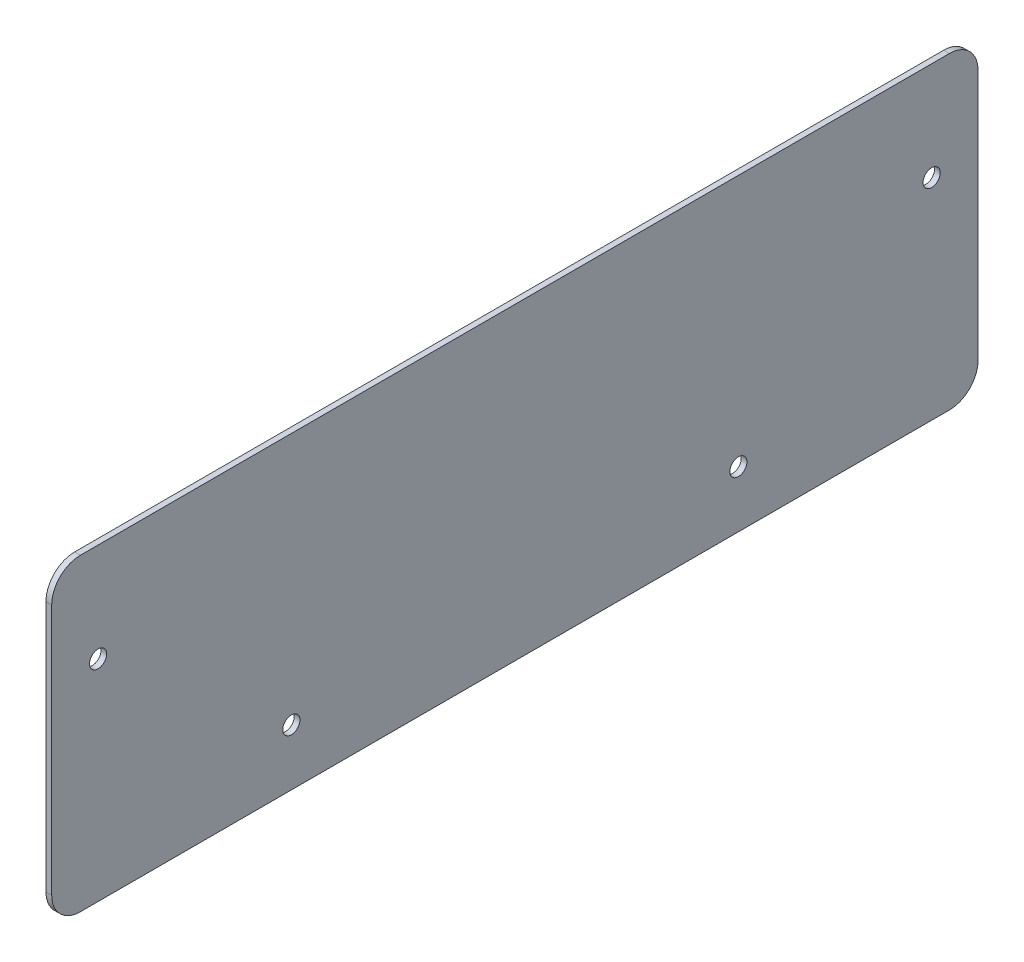
ISO-10303-21;
HEADER;
FILE_DESCRIPTION(('STEP AP214'),'2;1');
FILE_NAME('part.step','',(''),(''),'','','');
FILE_SCHEMA(('AUTOMOTIVE_DESIGN { 1 0 10303 214 1 1 1 1 }'));
ENDSEC;
DATA;
#1=APPLICATION_CONTEXT('core data for automotive mechanical design processes');
#2=APPLICATION_PROTOCOL_DEFINITION('international standard','automotive_design',2000,#1);
#3=PRODUCT_CONTEXT('',#1,'mechanical');
#4=PRODUCT('Part','Part','',(#3));
#5=PRODUCT_RELATED_PRODUCT_CATEGORY('part','',(#4));
#6=PRODUCT_DEFINITION_FORMATION('','',#4);
#7=PRODUCT_DEFINITION_CONTEXT('part definition',#1,'design');
#8=PRODUCT_DEFINITION('design','',#6,#7);
#9=PRODUCT_DEFINITION_SHAPE('','',#8);
#10=(LENGTH_UNIT() NAMED_UNIT(*) SI_UNIT(.MILLI.,.METRE.));
#11=(NAMED_UNIT(*) PLANE_ANGLE_UNIT() SI_UNIT($,.RADIAN.));
#12=(NAMED_UNIT(*) SI_UNIT($,.STERADIAN.) SOLID_ANGLE_UNIT());
#13=UNCERTAINTY_MEASURE_WITH_UNIT(LENGTH_MEASURE(1.E-05),#10,'distance_accuracy_value','');
#14=(GEOMETRIC_REPRESENTATION_CONTEXT(3) GLOBAL_UNCERTAINTY_ASSIGNED_CONTEXT((#13)) GLOBAL_UNIT_ASSIGNED_CONTEXT((#10,
#11,#12)) REPRESENTATION_CONTEXT('',''));
#15=CARTESIAN_POINT('',(0.,0.,0.));
#16=DIRECTION('',(0.,0.,1.));
#17=DIRECTION('',(1.,0.,0.));
#18=AXIS2_PLACEMENT_3D('',#15,#16,#17);
#19=CARTESIAN_POINT('',(-2.,-54.,-162.));
#20=DIRECTION('',(0.,0.,-1.));
#21=DIRECTION('',(-1.,0.,0.));
#22=AXIS2_PLACEMENT_3D('',#19,#20,#21);
#23=PLANE('',#22);
#24=DIRECTION('',(0.,1.,0.));
#25=VECTOR('',#24,1.);
#26=CARTESIAN_POINT('',(0.,-54.,-162.));
#27=LINE('',#26,#25);
#28=CARTESIAN_POINT('',(0.,-44.,-162.));
#29=VERTEX_POINT('',#28);
#30=CARTESIAN_POINT('',(0.,44.,-162.));
#31=VERTEX_POINT('',#30);
#32=EDGE_CURVE('E172',#29,#31,#27,.T.);
#33=ORIENTED_EDGE('',*,*,#32,.F.);
#34=DIRECTION('',(1.,0.,0.));
#35=VECTOR('',#34,1.);
#36=CARTESIAN_POINT('',(-2.,-44.,-162.));
#37=LINE('',#36,#35);
#38=CARTESIAN_POINT('',(-2.,-44.,-162.));
#39=VERTEX_POINT('',#38);
#40=EDGE_CURVE('E149',#29,#39,#37,.F.);
#41=ORIENTED_EDGE('',*,*,#40,.T.);
#42=DIRECTION('',(0.,1.,0.));
#43=VECTOR('',#42,1.);
#44=CARTESIAN_POINT('',(-2.,-54.,-162.));
#45=LINE('',#44,#43);
#46=CARTESIAN_POINT('',(-2.,44.,-162.));
#47=VERTEX_POINT('',#46);
#48=EDGE_CURVE('E129',#39,#47,#45,.T.);
#49=ORIENTED_EDGE('',*,*,#48,.T.);
#50=DIRECTION('',(1.,0.,0.));
#51=VECTOR('',#50,1.);
#52=CARTESIAN_POINT('',(-2.,44.,-162.));
#53=LINE('',#52,#51);
#54=EDGE_CURVE('E146',#47,#31,#53,.T.);
#55=ORIENTED_EDGE('',*,*,#54,.T.);
#56=EDGE_LOOP('',(#33,#41,#49,#55));
#57=FACE_BOUND('',#56,.T.);
#58=ADVANCED_FACE('F42',(#57),#23,.T.);
#59=CARTESIAN_POINT('',(-2.,-54.,162.));
#60=DIRECTION('',(0.,-1.,0.));
#61=DIRECTION('',(0.,0.,-1.));
#62=AXIS2_PLACEMENT_3D('',#59,#60,#61);
#63=PLANE('',#62);
#64=DIRECTION('',(0.,0.,-1.));
#65=VECTOR('',#64,1.);
#66=CARTESIAN_POINT('',(-2.,-54.,162.));
#67=LINE('',#66,#65);
#68=CARTESIAN_POINT('',(-2.,-54.,152.));
#69=VERTEX_POINT('',#68);
#70=CARTESIAN_POINT('',(-2.,-54.,-152.));
#71=VERTEX_POINT('',#70);
#72=EDGE_CURVE('E133',#69,#71,#67,.T.);
#73=ORIENTED_EDGE('',*,*,#72,.T.);
#74=DIRECTION('',(1.,0.,0.));
#75=VECTOR('',#74,1.);
#76=CARTESIAN_POINT('',(-2.,-54.,-152.));
#77=LINE('',#76,#75);
#78=CARTESIAN_POINT('',(0.,-54.,-152.));
#79=VERTEX_POINT('',#78);
#80=EDGE_CURVE('E119',#71,#79,#77,.T.);
#81=ORIENTED_EDGE('',*,*,#80,.T.);
#82=DIRECTION('',(0.,0.,-1.));
#83=VECTOR('',#82,1.);
#84=CARTESIAN_POINT('',(0.,-54.,162.));
#85=LINE('',#84,#83);
#86=CARTESIAN_POINT('',(0.,-54.,152.));
#87=VERTEX_POINT('',#86);
#88=EDGE_CURVE('E111',#87,#79,#85,.T.);
#89=ORIENTED_EDGE('',*,*,#88,.F.);
#90=DIRECTION('',(1.,0.,0.));
#91=VECTOR('',#90,1.);
#92=CARTESIAN_POINT('',(-2.,-54.,152.));
#93=LINE('',#92,#91);
#94=EDGE_CURVE('E125',#87,#69,#93,.F.);
#95=ORIENTED_EDGE('',*,*,#94,.T.);
#96=EDGE_LOOP('',(#73,#81,#89,#95));
#97=FACE_BOUND('',#96,.T.);
#98=ADVANCED_FACE('F124',(#97),#63,.T.);
#99=CARTESIAN_POINT('',(-2.,-54.,162.));
#100=DIRECTION('',(0.,0.,1.));
#101=DIRECTION('',(1.,0.,0.));
#102=AXIS2_PLACEMENT_3D('',#99,#100,#101);
#103=PLANE('',#102);
#104=DIRECTION('',(0.,-1.,0.));
#105=VECTOR('',#104,1.);
#106=CARTESIAN_POINT('',(0.,-54.,162.));
#107=LINE('',#106,#105);
#108=CARTESIAN_POINT('',(0.,44.,162.));
#109=VERTEX_POINT('',#108);
#110=CARTESIAN_POINT('',(0.,-44.,162.));
#111=VERTEX_POINT('',#110);
#112=EDGE_CURVE('E113',#109,#111,#107,.T.);
#113=ORIENTED_EDGE('',*,*,#112,.F.);
#114=DIRECTION('',(1.,0.,0.));
#115=VECTOR('',#114,1.);
#116=CARTESIAN_POINT('',(-2.,44.,162.));
#117=LINE('',#116,#115);
#118=CARTESIAN_POINT('',(-2.,44.,162.));
#119=VERTEX_POINT('',#118);
#120=EDGE_CURVE('E11',#109,#119,#117,.F.);
#121=ORIENTED_EDGE('',*,*,#120,.T.);
#122=DIRECTION('',(0.,-1.,0.));
#123=VECTOR('',#122,1.);
#124=CARTESIAN_POINT('',(-2.,-54.,162.));
#125=LINE('',#124,#123);
#126=CARTESIAN_POINT('',(-2.,-44.,162.));
#127=VERTEX_POINT('',#126);
#128=EDGE_CURVE('E137',#119,#127,#125,.T.);
#129=ORIENTED_EDGE('',*,*,#128,.T.);
#130=DIRECTION('',(1.,0.,0.));
#131=VECTOR('',#130,1.);
#132=CARTESIAN_POINT('',(-2.,-44.,162.));
#133=LINE('',#132,#131);
#134=EDGE_CURVE('E50',#127,#111,#133,.T.);
#135=ORIENTED_EDGE('',*,*,#134,.T.);
#136=EDGE_LOOP('',(#113,#121,#129,#135));
#137=FACE_BOUND('',#136,.T.);
#138=ADVANCED_FACE('F162',(#137),#103,.T.);
#139=CARTESIAN_POINT('',(-2.,54.,162.));
#140=DIRECTION('',(0.,1.,0.));
#141=DIRECTION('',(0.,0.,1.));
#142=AXIS2_PLACEMENT_3D('',#139,#140,#141);
#143=PLANE('',#142);
#144=DIRECTION('',(0.,0.,1.));
#145=VECTOR('',#144,1.);
#146=CARTESIAN_POINT('',(0.,54.,162.));
#147=LINE('',#146,#145);
#148=CARTESIAN_POINT('',(0.,54.,-152.));
#149=VERTEX_POINT('',#148);
#150=CARTESIAN_POINT('',(0.,54.,152.));
#151=VERTEX_POINT('',#150);
#152=EDGE_CURVE('E176',#149,#151,#147,.T.);
#153=ORIENTED_EDGE('',*,*,#152,.F.);
#154=DIRECTION('',(1.,0.,0.));
#155=VECTOR('',#154,1.);
#156=CARTESIAN_POINT('',(-2.,54.,-152.));
#157=LINE('',#156,#155);
#158=CARTESIAN_POINT('',(-2.,54.,-152.));
#159=VERTEX_POINT('',#158);
#160=EDGE_CURVE('E64',#149,#159,#157,.F.);
#161=ORIENTED_EDGE('',*,*,#160,.T.);
#162=DIRECTION('',(0.,0.,1.));
#163=VECTOR('',#162,1.);
#164=CARTESIAN_POINT('',(-2.,54.,162.));
#165=LINE('',#164,#163);
#166=CARTESIAN_POINT('',(-2.,54.,152.));
#167=VERTEX_POINT('',#166);
#168=EDGE_CURVE('E165',#159,#167,#165,.T.);
#169=ORIENTED_EDGE('',*,*,#168,.T.);
#170=DIRECTION('',(1.,0.,0.));
#171=VECTOR('',#170,1.);
#172=CARTESIAN_POINT('',(-2.,54.,152.));
#173=LINE('',#172,#171);
#174=EDGE_CURVE('E157',#167,#151,#173,.T.);
#175=ORIENTED_EDGE('',*,*,#174,.T.);
#176=EDGE_LOOP('',(#153,#161,#169,#175));
#177=FACE_BOUND('',#176,.T.);
#178=ADVANCED_FACE('F254',(#177),#143,.T.);
#179=CARTESIAN_POINT('',(-2.,0.,0.));
#180=DIRECTION('',(-1.,0.,0.));
#181=DIRECTION('',(0.,0.,1.));
#182=AXIS2_PLACEMENT_3D('',#179,#180,#181);
#183=PLANE('',#182);
#184=CARTESIAN_POINT('',(-2.,19.5000000000001,-145.781989417244));
#185=DIRECTION('',(-1.,0.,0.));
#186=DIRECTION('',(0.,0.,1.));
#187=AXIS2_PLACEMENT_3D('',#184,#185,#186);
#188=CIRCLE('',#187,2.99999999999999);
#189=CARTESIAN_POINT('',(-2.,19.5000000000001,-142.781989417244));
#190=VERTEX_POINT('',#189);
#191=EDGE_CURVE('E192',#190,#190,#188,.T.);
#192=ORIENTED_EDGE('',*,*,#191,.F.);
#193=EDGE_LOOP('',(#192));
#194=FACE_BOUND('',#193,.T.);
#195=CARTESIAN_POINT('',(-2.,-34.2695676665339,-78.1843784220302));
#196=DIRECTION('',(-1.,0.,0.));
#197=DIRECTION('',(0.,0.,1.));
#198=AXIS2_PLACEMENT_3D('',#195,#196,#197);
#199=CIRCLE('',#198,3.00000000000001);
#200=CARTESIAN_POINT('',(-2.,-34.2695676665339,-75.1843784220302));
#201=VERTEX_POINT('',#200);
#202=EDGE_CURVE('E207',#201,#201,#199,.T.);
#203=ORIENTED_EDGE('',*,*,#202,.F.);
#204=EDGE_LOOP('',(#203));
#205=FACE_BOUND('',#204,.T.);
#206=CARTESIAN_POINT('',(-2.,19.5000000000001,145.781989417244));
#207=DIRECTION('',(-1.,0.,0.));
#208=DIRECTION('',(0.,0.,1.));
#209=AXIS2_PLACEMENT_3D('',#206,#207,#208);
#210=CIRCLE('',#209,2.99999999999999);
#211=CARTESIAN_POINT('',(-2.,19.5000000000001,148.781989417244));
#212=VERTEX_POINT('',#211);
#213=EDGE_CURVE('E197',#212,#212,#210,.F.);
#214=ORIENTED_EDGE('',*,*,#213,.T.);
#215=EDGE_LOOP('',(#214));
#216=FACE_BOUND('',#215,.T.);
#217=CARTESIAN_POINT('',(-2.,-34.2695676665339,78.1843784220302));
#218=DIRECTION('',(-1.,0.,0.));
#219=DIRECTION('',(0.,0.,1.));
#220=AXIS2_PLACEMENT_3D('',#217,#218,#219);
#221=CIRCLE('',#220,3.00000000000001);
#222=CARTESIAN_POINT('',(-2.,-34.2695676665339,81.1843784220302));
#223=VERTEX_POINT('',#222);
#224=EDGE_CURVE('E187',#223,#223,#221,.F.);
#225=ORIENTED_EDGE('',*,*,#224,.T.);
#226=EDGE_LOOP('',(#225));
#227=FACE_BOUND('',#226,.T.);
#228=ORIENTED_EDGE('',*,*,#48,.F.);
#229=CARTESIAN_POINT('',(-2.,-44.,-152.));
#230=DIRECTION('',(-1.,0.,0.));
#231=DIRECTION('',(0.,0.,1.));
#232=AXIS2_PLACEMENT_3D('',#229,#230,#231);
#233=CIRCLE('',#232,10.);
#234=EDGE_CURVE('E155',#39,#71,#233,.T.);
#235=ORIENTED_EDGE('',*,*,#234,.T.);
#236=ORIENTED_EDGE('',*,*,#72,.F.);
#237=CARTESIAN_POINT('',(-2.,-44.,152.));
#238=DIRECTION('',(-1.,0.,0.));
#239=DIRECTION('',(0.,0.,1.));
#240=AXIS2_PLACEMENT_3D('',#237,#238,#239);
#241=CIRCLE('',#240,10.);
#242=EDGE_CURVE('E132',#69,#127,#241,.T.);
#243=ORIENTED_EDGE('',*,*,#242,.T.);
#244=ORIENTED_EDGE('',*,*,#128,.F.);
#245=CARTESIAN_POINT('',(-2.,44.,152.));
#246=DIRECTION('',(-1.,0.,0.));
#247=DIRECTION('',(0.,0.,1.));
#248=AXIS2_PLACEMENT_3D('',#245,#246,#247);
#249=CIRCLE('',#248,10.);
#250=EDGE_CURVE('E57',#119,#167,#249,.T.);
#251=ORIENTED_EDGE('',*,*,#250,.T.);
#252=ORIENTED_EDGE('',*,*,#168,.F.);
#253=CARTESIAN_POINT('',(-2.,44.,-152.));
#254=DIRECTION('',(-1.,0.,0.));
#255=DIRECTION('',(0.,0.,1.));
#256=AXIS2_PLACEMENT_3D('',#253,#254,#255);
#257=CIRCLE('',#256,10.);
#258=EDGE_CURVE('E153',#159,#47,#257,.T.);
#259=ORIENTED_EDGE('',*,*,#258,.T.);
#260=EDGE_LOOP('',(#228,#235,#236,#243,#244,#251,#252,#259));
#261=FACE_BOUND('',#260,.T.);
#262=ADVANCED_FACE('F271',(#194,#205,#216,#227,#261),#183,.T.);
#263=CARTESIAN_POINT('',(0.,0.,0.));
#264=DIRECTION('',(-1.,0.,0.));
#265=DIRECTION('',(0.,0.,1.));
#266=AXIS2_PLACEMENT_3D('',#263,#264,#265);
#267=PLANE('',#266);
#268=CARTESIAN_POINT('',(0.,19.5000000000001,-145.781989417244));
#269=DIRECTION('',(-1.,0.,0.));
#270=DIRECTION('',(0.,0.,1.));
#271=AXIS2_PLACEMENT_3D('',#268,#269,#270);
#272=CIRCLE('',#271,2.99999999999999);
#273=CARTESIAN_POINT('',(0.,19.5000000000001,-142.781989417244));
#274=VERTEX_POINT('',#273);
#275=EDGE_CURVE('E211',#274,#274,#272,.T.);
#276=ORIENTED_EDGE('',*,*,#275,.T.);
#277=EDGE_LOOP('',(#276));
#278=FACE_BOUND('',#277,.T.);
#279=CARTESIAN_POINT('',(0.,-34.2695676665339,-78.1843784220302));
#280=DIRECTION('',(-1.,0.,0.));
#281=DIRECTION('',(0.,0.,1.));
#282=AXIS2_PLACEMENT_3D('',#279,#280,#281);
#283=CIRCLE('',#282,3.00000000000001);
#284=CARTESIAN_POINT('',(0.,-34.2695676665339,-75.1843784220302));
#285=VERTEX_POINT('',#284);
#286=EDGE_CURVE('E212',#285,#285,#283,.T.);
#287=ORIENTED_EDGE('',*,*,#286,.T.);
#288=EDGE_LOOP('',(#287));
#289=FACE_BOUND('',#288,.T.);
#290=CARTESIAN_POINT('',(0.,19.5000000000001,145.781989417244));
#291=DIRECTION('',(1.,0.,0.));
#292=DIRECTION('',(0.,0.,-1.));
#293=AXIS2_PLACEMENT_3D('',#290,#291,#292);
#294=CIRCLE('',#293,2.99999999999999);
#295=CARTESIAN_POINT('',(0.,19.5000000000001,142.781989417244));
#296=VERTEX_POINT('',#295);
#297=EDGE_CURVE('E177',#296,#296,#294,.T.);
#298=ORIENTED_EDGE('',*,*,#297,.F.);
#299=EDGE_LOOP('',(#298));
#300=FACE_BOUND('',#299,.T.);
#301=CARTESIAN_POINT('',(0.,-34.2695676665339,78.1843784220302));
#302=DIRECTION('',(1.,0.,0.));
#303=DIRECTION('',(0.,0.,-1.));
#304=AXIS2_PLACEMENT_3D('',#301,#302,#303);
#305=CIRCLE('',#304,3.00000000000001);
#306=CARTESIAN_POINT('',(0.,-34.2695676665339,75.1843784220302));
#307=VERTEX_POINT('',#306);
#308=EDGE_CURVE('E191',#307,#307,#305,.T.);
#309=ORIENTED_EDGE('',*,*,#308,.F.);
#310=EDGE_LOOP('',(#309));
#311=FACE_BOUND('',#310,.T.);
#312=ORIENTED_EDGE('',*,*,#88,.T.);
#313=CARTESIAN_POINT('',(0.,-44.,-152.));
#314=DIRECTION('',(-1.,0.,0.));
#315=DIRECTION('',(0.,0.,1.));
#316=AXIS2_PLACEMENT_3D('',#313,#314,#315);
#317=CIRCLE('',#316,10.);
#318=EDGE_CURVE('E144',#79,#29,#317,.F.);
#319=ORIENTED_EDGE('',*,*,#318,.T.);
#320=ORIENTED_EDGE('',*,*,#32,.T.);
#321=CARTESIAN_POINT('',(0.,44.,-152.));
#322=DIRECTION('',(-1.,0.,0.));
#323=DIRECTION('',(0.,0.,1.));
#324=AXIS2_PLACEMENT_3D('',#321,#322,#323);
#325=CIRCLE('',#324,10.);
#326=EDGE_CURVE('E142',#31,#149,#325,.F.);
#327=ORIENTED_EDGE('',*,*,#326,.T.);
#328=ORIENTED_EDGE('',*,*,#152,.T.);
#329=CARTESIAN_POINT('',(0.,44.,152.));
#330=DIRECTION('',(-1.,0.,0.));
#331=DIRECTION('',(0.,0.,1.));
#332=AXIS2_PLACEMENT_3D('',#329,#330,#331);
#333=CIRCLE('',#332,10.);
#334=EDGE_CURVE('E118',#151,#109,#333,.F.);
#335=ORIENTED_EDGE('',*,*,#334,.T.);
#336=ORIENTED_EDGE('',*,*,#112,.T.);
#337=CARTESIAN_POINT('',(0.,-44.,152.));
#338=DIRECTION('',(-1.,0.,0.));
#339=DIRECTION('',(0.,0.,1.));
#340=AXIS2_PLACEMENT_3D('',#337,#338,#339);
#341=CIRCLE('',#340,10.);
#342=EDGE_CURVE('E108',#111,#87,#341,.F.);
#343=ORIENTED_EDGE('',*,*,#342,.T.);
#344=EDGE_LOOP('',(#312,#319,#320,#327,#328,#335,#336,#343));
#345=FACE_BOUND('',#344,.T.);
#346=ADVANCED_FACE('F110',(#278,#289,#300,#311,#345),#267,.F.);
#347=CARTESIAN_POINT('',(-2.00099999999998,-34.2695676665339,78.1843784220302));
#348=DIRECTION('',(1.,0.,0.));
#349=DIRECTION('',(0.,0.,-1.));
#350=AXIS2_PLACEMENT_3D('',#347,#348,#349);
#351=CYLINDRICAL_SURFACE('',#350,3.00000000000001);
#352=ORIENTED_EDGE('',*,*,#224,.F.);
#353=EDGE_LOOP('',(#352));
#354=FACE_BOUND('',#353,.T.);
#355=ORIENTED_EDGE('',*,*,#308,.T.);
#356=EDGE_LOOP('',(#355));
#357=FACE_BOUND('',#356,.T.);
#358=ADVANCED_FACE('F279',(#354,#357),#351,.F.);
#359=CARTESIAN_POINT('',(-2.00099999999998,19.5000000000001,145.781989417244));
#360=DIRECTION('',(1.,0.,0.));
#361=DIRECTION('',(0.,0.,-1.));
#362=AXIS2_PLACEMENT_3D('',#359,#360,#361);
#363=CYLINDRICAL_SURFACE('',#362,2.99999999999999);
#364=ORIENTED_EDGE('',*,*,#213,.F.);
#365=EDGE_LOOP('',(#364));
#366=FACE_BOUND('',#365,.T.);
#367=ORIENTED_EDGE('',*,*,#297,.T.);
#368=EDGE_LOOP('',(#367));
#369=FACE_BOUND('',#368,.T.);
#370=ADVANCED_FACE('F242',(#366,#369),#363,.F.);
#371=CARTESIAN_POINT('',(-2.00099999999998,-34.2695676665339,-78.1843784220302));
#372=DIRECTION('',(1.,0.,0.));
#373=DIRECTION('',(0.,0.,-1.));
#374=AXIS2_PLACEMENT_3D('',#371,#372,#373);
#375=CYLINDRICAL_SURFACE('',#374,3.00000000000001);
#376=ORIENTED_EDGE('',*,*,#202,.T.);
#377=EDGE_LOOP('',(#376));
#378=FACE_BOUND('',#377,.T.);
#379=ORIENTED_EDGE('',*,*,#286,.F.);
#380=EDGE_LOOP('',(#379));
#381=FACE_BOUND('',#380,.T.);
#382=ADVANCED_FACE('F232',(#378,#381),#375,.F.);
#383=CARTESIAN_POINT('',(-2.00100000000003,19.5000000000001,-145.781989417244));
#384=DIRECTION('',(1.,0.,0.));
#385=DIRECTION('',(0.,0.,-1.));
#386=AXIS2_PLACEMENT_3D('',#383,#384,#385);
#387=CYLINDRICAL_SURFACE('',#386,2.99999999999999);
#388=ORIENTED_EDGE('',*,*,#191,.T.);
#389=EDGE_LOOP('',(#388));
#390=FACE_BOUND('',#389,.T.);
#391=ORIENTED_EDGE('',*,*,#275,.F.);
#392=EDGE_LOOP('',(#391));
#393=FACE_BOUND('',#392,.T.);
#394=ADVANCED_FACE('F229',(#390,#393),#387,.F.);
#395=CARTESIAN_POINT('',(-2.,-44.,-152.));
#396=DIRECTION('',(1.,0.,0.));
#397=DIRECTION('',(0.,0.,-1.));
#398=AXIS2_PLACEMENT_3D('',#395,#396,#397);
#399=CYLINDRICAL_SURFACE('',#398,10.);
#400=ORIENTED_EDGE('',*,*,#234,.F.);
#401=ORIENTED_EDGE('',*,*,#40,.F.);
#402=ORIENTED_EDGE('',*,*,#318,.F.);
#403=ORIENTED_EDGE('',*,*,#80,.F.);
#404=EDGE_LOOP('',(#400,#401,#402,#403));
#405=FACE_BOUND('',#404,.T.);
#406=ADVANCED_FACE('F231',(#405),#399,.T.);
#407=CARTESIAN_POINT('',(-2.,44.,-152.));
#408=DIRECTION('',(1.,0.,0.));
#409=DIRECTION('',(0.,0.,-1.));
#410=AXIS2_PLACEMENT_3D('',#407,#408,#409);
#411=CYLINDRICAL_SURFACE('',#410,10.);
#412=ORIENTED_EDGE('',*,*,#258,.F.);
#413=ORIENTED_EDGE('',*,*,#160,.F.);
#414=ORIENTED_EDGE('',*,*,#326,.F.);
#415=ORIENTED_EDGE('',*,*,#54,.F.);
#416=EDGE_LOOP('',(#412,#413,#414,#415));
#417=FACE_BOUND('',#416,.T.);
#418=ADVANCED_FACE('F239',(#417),#411,.T.);
#419=CARTESIAN_POINT('',(-2.,44.,152.));
#420=DIRECTION('',(1.,0.,0.));
#421=DIRECTION('',(0.,0.,-1.));
#422=AXIS2_PLACEMENT_3D('',#419,#420,#421);
#423=CYLINDRICAL_SURFACE('',#422,10.);
#424=ORIENTED_EDGE('',*,*,#250,.F.);
#425=ORIENTED_EDGE('',*,*,#120,.F.);
#426=ORIENTED_EDGE('',*,*,#334,.F.);
#427=ORIENTED_EDGE('',*,*,#174,.F.);
#428=EDGE_LOOP('',(#424,#425,#426,#427));
#429=FACE_BOUND('',#428,.T.);
#430=ADVANCED_FACE('F258',(#429),#423,.T.);
#431=CARTESIAN_POINT('',(-2.,-44.,152.));
#432=DIRECTION('',(1.,0.,0.));
#433=DIRECTION('',(0.,0.,-1.));
#434=AXIS2_PLACEMENT_3D('',#431,#432,#433);
#435=CYLINDRICAL_SURFACE('',#434,10.);
#436=ORIENTED_EDGE('',*,*,#242,.F.);
#437=ORIENTED_EDGE('',*,*,#94,.F.);
#438=ORIENTED_EDGE('',*,*,#342,.F.);
#439=ORIENTED_EDGE('',*,*,#134,.F.);
#440=EDGE_LOOP('',(#436,#437,#438,#439));
#441=FACE_BOUND('',#440,.T.);
#442=ADVANCED_FACE('F44',(#441),#435,.T.);
#443=CLOSED_SHELL('',(#58,#98,#138,#178,#262,#346,#358,#370,#382,#394,#406,#418,#430,#442));
#444=MANIFOLD_SOLID_BREP('B2',#443);
#445=ADVANCED_BREP_SHAPE_REPRESENTATION('',(#18,#444),#14);
#446=SHAPE_DEFINITION_REPRESENTATION(#9,#445);
ENDSEC;
END-ISO-10303-21;
